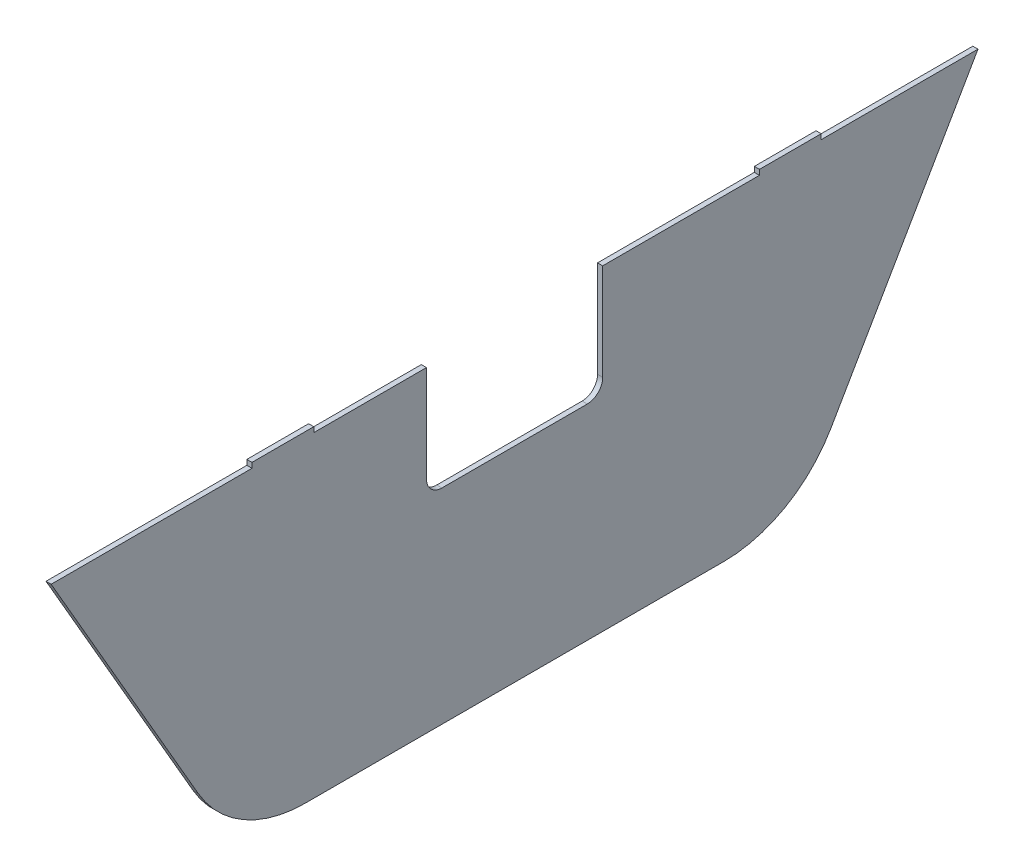
ISO-10303-21;
HEADER;
FILE_DESCRIPTION(('STEP AP214'),'2;1');
FILE_NAME('part.step','',(''),(''),'','','');
FILE_SCHEMA(('AUTOMOTIVE_DESIGN { 1 0 10303 214 1 1 1 1 }'));
ENDSEC;
DATA;
#1=APPLICATION_CONTEXT('core data for automotive mechanical design processes');
#2=APPLICATION_PROTOCOL_DEFINITION('international standard','automotive_design',2000,#1);
#3=PRODUCT_CONTEXT('',#1,'mechanical');
#4=PRODUCT('Part','Part','',(#3));
#5=PRODUCT_RELATED_PRODUCT_CATEGORY('part','',(#4));
#6=PRODUCT_DEFINITION_FORMATION('','',#4);
#7=PRODUCT_DEFINITION_CONTEXT('part definition',#1,'design');
#8=PRODUCT_DEFINITION('design','',#6,#7);
#9=PRODUCT_DEFINITION_SHAPE('','',#8);
#10=(LENGTH_UNIT() NAMED_UNIT(*) SI_UNIT(.MILLI.,.METRE.));
#11=(NAMED_UNIT(*) PLANE_ANGLE_UNIT() SI_UNIT($,.RADIAN.));
#12=(NAMED_UNIT(*) SI_UNIT($,.STERADIAN.) SOLID_ANGLE_UNIT());
#13=UNCERTAINTY_MEASURE_WITH_UNIT(LENGTH_MEASURE(1.E-05),#10,'distance_accuracy_value','');
#14=(GEOMETRIC_REPRESENTATION_CONTEXT(3) GLOBAL_UNCERTAINTY_ASSIGNED_CONTEXT((#13)) GLOBAL_UNIT_ASSIGNED_CONTEXT((#10,
#11,#12)) REPRESENTATION_CONTEXT('',''));
#15=CARTESIAN_POINT('',(0.,0.,0.));
#16=DIRECTION('',(0.,0.,1.));
#17=DIRECTION('',(1.,0.,0.));
#18=AXIS2_PLACEMENT_3D('',#15,#16,#17);
#19=CARTESIAN_POINT('',(2.,-2609.80652232953,-39.90228933812));
#20=DIRECTION('',(-1.,0.,0.));
#21=DIRECTION('',(0.,0.,1.));
#22=AXIS2_PLACEMENT_3D('',#19,#20,#21);
#23=CYLINDRICAL_SURFACE('',#22,47.9999999999999);
#24=CARTESIAN_POINT('',(0.,-2609.80652232953,-39.90228933812));
#25=DIRECTION('',(1.,0.,0.));
#26=DIRECTION('',(0.,0.,-1.));
#27=AXIS2_PLACEMENT_3D('',#24,#25,#26);
#28=CIRCLE('',#27,47.9999999999999);
#29=CARTESIAN_POINT('',(0.,-2633.80652232953,1.66693004353317));
#30=VERTEX_POINT('',#29);
#31=CARTESIAN_POINT('',(0.,-2657.80652232953,-39.90228933812));
#32=VERTEX_POINT('',#31);
#33=EDGE_CURVE('E205',#30,#32,#28,.T.);
#34=ORIENTED_EDGE('',*,*,#33,.T.);
#35=DIRECTION('',(-1.,0.,0.));
#36=VECTOR('',#35,1.);
#37=CARTESIAN_POINT('',(2.,-2657.80652232953,-39.90228933812));
#38=LINE('',#37,#36);
#39=CARTESIAN_POINT('',(2.,-2657.80652232953,-39.90228933812));
#40=VERTEX_POINT('',#39);
#41=EDGE_CURVE('E11',#40,#32,#38,.T.);
#42=ORIENTED_EDGE('',*,*,#41,.F.);
#43=CARTESIAN_POINT('',(2.,-2609.80652232953,-39.90228933812));
#44=DIRECTION('',(1.,0.,0.));
#45=DIRECTION('',(0.,0.,-1.));
#46=AXIS2_PLACEMENT_3D('',#43,#44,#45);
#47=CIRCLE('',#46,47.9999999999999);
#48=CARTESIAN_POINT('',(2.,-2633.80652232953,1.66693004353317));
#49=VERTEX_POINT('',#48);
#50=EDGE_CURVE('E256',#49,#40,#47,.T.);
#51=ORIENTED_EDGE('',*,*,#50,.F.);
#52=DIRECTION('',(-1.,0.,0.));
#53=VECTOR('',#52,1.);
#54=CARTESIAN_POINT('',(2.,-2633.80652232953,1.66693004353317));
#55=LINE('',#54,#53);
#56=EDGE_CURVE('E201',#49,#30,#55,.T.);
#57=ORIENTED_EDGE('',*,*,#56,.T.);
#58=EDGE_LOOP('',(#34,#42,#51,#57));
#59=FACE_BOUND('',#58,.T.);
#60=ADVANCED_FACE('F39',(#59),#23,.T.);
#61=CARTESIAN_POINT('',(2.,-2657.80652232953,-39.90228933812));
#62=DIRECTION('',(0.,1.,0.));
#63=DIRECTION('',(0.,0.,1.));
#64=AXIS2_PLACEMENT_3D('',#61,#62,#63);
#65=PLANE('',#64);
#66=DIRECTION('',(0.,0.,-1.));
#67=VECTOR('',#66,1.);
#68=CARTESIAN_POINT('',(0.,-2657.80652232953,-39.90228933812));
#69=LINE('',#68,#67);
#70=CARTESIAN_POINT('',(0.,-2657.80652232953,-202.448497275268));
#71=VERTEX_POINT('',#70);
#72=EDGE_CURVE('E208',#32,#71,#69,.T.);
#73=ORIENTED_EDGE('',*,*,#72,.T.);
#74=DIRECTION('',(-1.,0.,0.));
#75=VECTOR('',#74,1.);
#76=CARTESIAN_POINT('',(2.,-2657.80652232953,-202.448497275268));
#77=LINE('',#76,#75);
#78=CARTESIAN_POINT('',(2.,-2657.80652232953,-202.448497275268));
#79=VERTEX_POINT('',#78);
#80=EDGE_CURVE('E47',#79,#71,#77,.T.);
#81=ORIENTED_EDGE('',*,*,#80,.F.);
#82=DIRECTION('',(0.,0.,-1.));
#83=VECTOR('',#82,1.);
#84=CARTESIAN_POINT('',(2.,-2657.80652232953,-39.90228933812));
#85=LINE('',#84,#83);
#86=EDGE_CURVE('E130',#40,#79,#85,.T.);
#87=ORIENTED_EDGE('',*,*,#86,.F.);
#88=ORIENTED_EDGE('',*,*,#41,.T.);
#89=EDGE_LOOP('',(#73,#81,#87,#88));
#90=FACE_BOUND('',#89,.T.);
#91=ADVANCED_FACE('F361',(#90),#65,.F.);
#92=CARTESIAN_POINT('',(2.,-2609.80652232953,-202.448497275268));
#93=DIRECTION('',(-1.,0.,0.));
#94=DIRECTION('',(0.,0.,1.));
#95=AXIS2_PLACEMENT_3D('',#92,#93,#94);
#96=CYLINDRICAL_SURFACE('',#95,48.0000000000001);
#97=CARTESIAN_POINT('',(0.,-2609.80652232953,-202.448497275268));
#98=DIRECTION('',(1.,0.,0.));
#99=DIRECTION('',(0.,0.,-1.));
#100=AXIS2_PLACEMENT_3D('',#97,#98,#99);
#101=CIRCLE('',#100,48.0000000000001);
#102=CARTESIAN_POINT('',(0.,-2633.80652232953,-244.017716656921));
#103=VERTEX_POINT('',#102);
#104=EDGE_CURVE('E210',#71,#103,#101,.T.);
#105=ORIENTED_EDGE('',*,*,#104,.T.);
#106=DIRECTION('',(-1.,0.,0.));
#107=VECTOR('',#106,1.);
#108=CARTESIAN_POINT('',(2.,-2633.80652232953,-244.017716656921));
#109=LINE('',#108,#107);
#110=CARTESIAN_POINT('',(2.,-2633.80652232953,-244.017716656921));
#111=VERTEX_POINT('',#110);
#112=EDGE_CURVE('E288',#111,#103,#109,.T.);
#113=ORIENTED_EDGE('',*,*,#112,.F.);
#114=CARTESIAN_POINT('',(2.,-2609.80652232953,-202.448497275268));
#115=DIRECTION('',(1.,0.,0.));
#116=DIRECTION('',(0.,0.,-1.));
#117=AXIS2_PLACEMENT_3D('',#114,#115,#116);
#118=CIRCLE('',#117,48.0000000000001);
#119=EDGE_CURVE('E296',#79,#111,#118,.T.);
#120=ORIENTED_EDGE('',*,*,#119,.F.);
#121=ORIENTED_EDGE('',*,*,#80,.T.);
#122=EDGE_LOOP('',(#105,#113,#120,#121));
#123=FACE_BOUND('',#122,.T.);
#124=ADVANCED_FACE('F294',(#123),#96,.T.);
#125=CARTESIAN_POINT('',(2.,-2633.80652232953,-244.017716656921));
#126=DIRECTION('',(0.,0.499999999999997,0.86602540378444));
#127=DIRECTION('',(0.,-0.86602540378444,0.499999999999997));
#128=AXIS2_PLACEMENT_3D('',#125,#126,#127);
#129=PLANE('',#128);
#130=DIRECTION('',(0.,0.86602540378444,-0.499999999999997));
#131=VECTOR('',#130,1.);
#132=CARTESIAN_POINT('',(0.,-2633.80652232953,-244.017716656921));
#133=LINE('',#132,#131);
#134=CARTESIAN_POINT('',(0.,-2534.80652232953,-301.175393306694));
#135=VERTEX_POINT('',#134);
#136=EDGE_CURVE('E212',#103,#135,#133,.T.);
#137=ORIENTED_EDGE('',*,*,#136,.T.);
#138=DIRECTION('',(-1.,0.,0.));
#139=VECTOR('',#138,1.);
#140=CARTESIAN_POINT('',(2.,-2534.80652232953,-301.175393306694));
#141=LINE('',#140,#139);
#142=CARTESIAN_POINT('',(2.,-2534.80652232953,-301.175393306694));
#143=VERTEX_POINT('',#142);
#144=EDGE_CURVE('E286',#143,#135,#141,.T.);
#145=ORIENTED_EDGE('',*,*,#144,.F.);
#146=DIRECTION('',(0.,0.86602540378444,-0.499999999999997));
#147=VECTOR('',#146,1.);
#148=CARTESIAN_POINT('',(2.,-2633.80652232953,-244.017716656921));
#149=LINE('',#148,#147);
#150=EDGE_CURVE('E308',#111,#143,#149,.T.);
#151=ORIENTED_EDGE('',*,*,#150,.F.);
#152=ORIENTED_EDGE('',*,*,#112,.T.);
#153=EDGE_LOOP('',(#137,#145,#151,#152));
#154=FACE_BOUND('',#153,.T.);
#155=ADVANCED_FACE('F305',(#154),#129,.F.);
#156=CARTESIAN_POINT('',(2.,-2534.80652232953,-240.287893306695));
#157=DIRECTION('',(0.,1.,0.));
#158=DIRECTION('',(0.,0.,1.));
#159=AXIS2_PLACEMENT_3D('',#156,#157,#158);
#160=PLANE('',#159);
#161=DIRECTION('',(0.,0.,-1.));
#162=VECTOR('',#161,1.);
#163=CARTESIAN_POINT('',(0.,-2534.80652232953,-240.287893306695));
#164=LINE('',#163,#162);
#165=CARTESIAN_POINT('',(0.,-2534.80652232953,-240.287893306695));
#166=VERTEX_POINT('',#165);
#167=EDGE_CURVE('E215',#166,#135,#164,.T.);
#168=ORIENTED_EDGE('',*,*,#167,.F.);
#169=DIRECTION('',(-1.,0.,0.));
#170=VECTOR('',#169,1.);
#171=CARTESIAN_POINT('',(2.,-2534.80652232953,-240.287893306695));
#172=LINE('',#171,#170);
#173=CARTESIAN_POINT('',(2.,-2534.80652232953,-240.287893306695));
#174=VERTEX_POINT('',#173);
#175=EDGE_CURVE('E284',#174,#166,#172,.T.);
#176=ORIENTED_EDGE('',*,*,#175,.F.);
#177=DIRECTION('',(0.,0.,-1.));
#178=VECTOR('',#177,1.);
#179=CARTESIAN_POINT('',(2.,-2534.80652232953,-240.287893306695));
#180=LINE('',#179,#178);
#181=EDGE_CURVE('E310',#174,#143,#180,.T.);
#182=ORIENTED_EDGE('',*,*,#181,.T.);
#183=ORIENTED_EDGE('',*,*,#144,.T.);
#184=EDGE_LOOP('',(#168,#176,#182,#183));
#185=FACE_BOUND('',#184,.T.);
#186=ADVANCED_FACE('F372',(#185),#160,.T.);
#187=CARTESIAN_POINT('',(2.,-2534.80652232953,-240.287893306695));
#188=DIRECTION('',(0.,0.,1.));
#189=DIRECTION('',(1.,0.,0.));
#190=AXIS2_PLACEMENT_3D('',#187,#188,#189);
#191=PLANE('',#190);
#192=DIRECTION('',(0.,1.,0.));
#193=VECTOR('',#192,1.);
#194=CARTESIAN_POINT('',(0.,-2534.80652232953,-240.287893306695));
#195=LINE('',#194,#193);
#196=CARTESIAN_POINT('',(0.,-2532.80652232953,-240.287893306695));
#197=VERTEX_POINT('',#196);
#198=EDGE_CURVE('E218',#166,#197,#195,.T.);
#199=ORIENTED_EDGE('',*,*,#198,.T.);
#200=DIRECTION('',(-1.,0.,0.));
#201=VECTOR('',#200,1.);
#202=CARTESIAN_POINT('',(2.,-2532.80652232953,-240.287893306695));
#203=LINE('',#202,#201);
#204=CARTESIAN_POINT('',(2.,-2532.80652232953,-240.287893306695));
#205=VERTEX_POINT('',#204);
#206=EDGE_CURVE('E282',#205,#197,#203,.T.);
#207=ORIENTED_EDGE('',*,*,#206,.F.);
#208=DIRECTION('',(0.,1.,0.));
#209=VECTOR('',#208,1.);
#210=CARTESIAN_POINT('',(2.,-2534.80652232953,-240.287893306695));
#211=LINE('',#210,#209);
#212=EDGE_CURVE('E312',#174,#205,#211,.T.);
#213=ORIENTED_EDGE('',*,*,#212,.F.);
#214=ORIENTED_EDGE('',*,*,#175,.T.);
#215=EDGE_LOOP('',(#199,#207,#213,#214));
#216=FACE_BOUND('',#215,.T.);
#217=ADVANCED_FACE('F375',(#216),#191,.F.);
#218=CARTESIAN_POINT('',(2.,-2532.80652232953,-216.287893306695));
#219=DIRECTION('',(0.,1.,0.));
#220=DIRECTION('',(0.,0.,1.));
#221=AXIS2_PLACEMENT_3D('',#218,#219,#220);
#222=PLANE('',#221);
#223=DIRECTION('',(0.,0.,-1.));
#224=VECTOR('',#223,1.);
#225=CARTESIAN_POINT('',(0.,-2532.80652232953,-216.287893306695));
#226=LINE('',#225,#224);
#227=CARTESIAN_POINT('',(0.,-2532.80652232953,-216.287893306695));
#228=VERTEX_POINT('',#227);
#229=EDGE_CURVE('E221',#228,#197,#226,.T.);
#230=ORIENTED_EDGE('',*,*,#229,.F.);
#231=DIRECTION('',(-1.,0.,0.));
#232=VECTOR('',#231,1.);
#233=CARTESIAN_POINT('',(2.,-2532.80652232953,-216.287893306695));
#234=LINE('',#233,#232);
#235=CARTESIAN_POINT('',(2.,-2532.80652232953,-216.287893306695));
#236=VERTEX_POINT('',#235);
#237=EDGE_CURVE('E280',#236,#228,#234,.T.);
#238=ORIENTED_EDGE('',*,*,#237,.F.);
#239=DIRECTION('',(0.,0.,-1.));
#240=VECTOR('',#239,1.);
#241=CARTESIAN_POINT('',(2.,-2532.80652232953,-216.287893306695));
#242=LINE('',#241,#240);
#243=EDGE_CURVE('E318',#236,#205,#242,.T.);
#244=ORIENTED_EDGE('',*,*,#243,.T.);
#245=ORIENTED_EDGE('',*,*,#206,.T.);
#246=EDGE_LOOP('',(#230,#238,#244,#245));
#247=FACE_BOUND('',#246,.T.);
#248=ADVANCED_FACE('F379',(#247),#222,.T.);
#249=CARTESIAN_POINT('',(2.,-2534.80652232953,-216.287893306695));
#250=DIRECTION('',(0.,0.,1.));
#251=DIRECTION('',(1.,0.,0.));
#252=AXIS2_PLACEMENT_3D('',#249,#250,#251);
#253=PLANE('',#252);
#254=DIRECTION('',(0.,1.,0.));
#255=VECTOR('',#254,1.);
#256=CARTESIAN_POINT('',(0.,-2534.80652232953,-216.287893306695));
#257=LINE('',#256,#255);
#258=CARTESIAN_POINT('',(0.,-2534.80652232953,-216.287893306695));
#259=VERTEX_POINT('',#258);
#260=EDGE_CURVE('E224',#259,#228,#257,.T.);
#261=ORIENTED_EDGE('',*,*,#260,.F.);
#262=DIRECTION('',(-1.,0.,0.));
#263=VECTOR('',#262,1.);
#264=CARTESIAN_POINT('',(2.,-2534.80652232953,-216.287893306695));
#265=LINE('',#264,#263);
#266=CARTESIAN_POINT('',(2.,-2534.80652232953,-216.287893306695));
#267=VERTEX_POINT('',#266);
#268=EDGE_CURVE('E278',#267,#259,#265,.T.);
#269=ORIENTED_EDGE('',*,*,#268,.F.);
#270=DIRECTION('',(0.,1.,0.));
#271=VECTOR('',#270,1.);
#272=CARTESIAN_POINT('',(2.,-2534.80652232953,-216.287893306695));
#273=LINE('',#272,#271);
#274=EDGE_CURVE('E321',#267,#236,#273,.T.);
#275=ORIENTED_EDGE('',*,*,#274,.T.);
#276=ORIENTED_EDGE('',*,*,#237,.T.);
#277=EDGE_LOOP('',(#261,#269,#275,#276));
#278=FACE_BOUND('',#277,.T.);
#279=ADVANCED_FACE('F383',(#278),#253,.T.);
#280=CARTESIAN_POINT('',(2.,-2534.80652232953,-155.400393306695));
#281=DIRECTION('',(0.,1.,0.));
#282=DIRECTION('',(0.,0.,1.));
#283=AXIS2_PLACEMENT_3D('',#280,#281,#282);
#284=PLANE('',#283);
#285=DIRECTION('',(0.,0.,-1.));
#286=VECTOR('',#285,1.);
#287=CARTESIAN_POINT('',(0.,-2534.80652232953,-155.400393306695));
#288=LINE('',#287,#286);
#289=CARTESIAN_POINT('',(0.,-2534.80652232953,-155.400393306695));
#290=VERTEX_POINT('',#289);
#291=EDGE_CURVE('E227',#290,#259,#288,.T.);
#292=ORIENTED_EDGE('',*,*,#291,.F.);
#293=DIRECTION('',(-1.,0.,0.));
#294=VECTOR('',#293,1.);
#295=CARTESIAN_POINT('',(2.,-2534.80652232953,-155.400393306695));
#296=LINE('',#295,#294);
#297=CARTESIAN_POINT('',(2.,-2534.80652232953,-155.400393306695));
#298=VERTEX_POINT('',#297);
#299=EDGE_CURVE('E276',#298,#290,#296,.T.);
#300=ORIENTED_EDGE('',*,*,#299,.F.);
#301=DIRECTION('',(0.,0.,-1.));
#302=VECTOR('',#301,1.);
#303=CARTESIAN_POINT('',(2.,-2534.80652232953,-155.400393306695));
#304=LINE('',#303,#302);
#305=EDGE_CURVE('E324',#298,#267,#304,.T.);
#306=ORIENTED_EDGE('',*,*,#305,.T.);
#307=ORIENTED_EDGE('',*,*,#268,.T.);
#308=EDGE_LOOP('',(#292,#300,#306,#307));
#309=FACE_BOUND('',#308,.T.);
#310=ADVANCED_FACE('F387',(#309),#284,.T.);
#311=CARTESIAN_POINT('',(2.,-2534.80652232953,-155.400393306695));
#312=DIRECTION('',(0.,0.,-1.));
#313=DIRECTION('',(-1.,0.,0.));
#314=AXIS2_PLACEMENT_3D('',#311,#312,#313);
#315=PLANE('',#314);
#316=DIRECTION('',(0.,-1.,0.));
#317=VECTOR('',#316,1.);
#318=CARTESIAN_POINT('',(0.,-2534.80652232953,-155.400393306695));
#319=LINE('',#318,#317);
#320=CARTESIAN_POINT('',(0.,-2572.30652232953,-155.400393306695));
#321=VERTEX_POINT('',#320);
#322=EDGE_CURVE('E230',#290,#321,#319,.T.);
#323=ORIENTED_EDGE('',*,*,#322,.T.);
#324=DIRECTION('',(-1.,0.,0.));
#325=VECTOR('',#324,1.);
#326=CARTESIAN_POINT('',(2.,-2572.30652232953,-155.400393306695));
#327=LINE('',#326,#325);
#328=CARTESIAN_POINT('',(2.,-2572.30652232953,-155.400393306695));
#329=VERTEX_POINT('',#328);
#330=EDGE_CURVE('E273',#329,#321,#327,.T.);
#331=ORIENTED_EDGE('',*,*,#330,.F.);
#332=DIRECTION('',(0.,-1.,0.));
#333=VECTOR('',#332,1.);
#334=CARTESIAN_POINT('',(2.,-2534.80652232953,-155.400393306695));
#335=LINE('',#334,#333);
#336=EDGE_CURVE('E327',#298,#329,#335,.T.);
#337=ORIENTED_EDGE('',*,*,#336,.F.);
#338=ORIENTED_EDGE('',*,*,#299,.T.);
#339=EDGE_LOOP('',(#323,#331,#337,#338));
#340=FACE_BOUND('',#339,.T.);
#341=ADVANCED_FACE('F391',(#340),#315,.F.);
#342=CARTESIAN_POINT('',(2.,-2572.30652232953,-149.400393306695));
#343=DIRECTION('',(-1.,0.,0.));
#344=DIRECTION('',(0.,0.,1.));
#345=AXIS2_PLACEMENT_3D('',#342,#343,#344);
#346=CYLINDRICAL_SURFACE('',#345,5.99999999999989);
#347=CARTESIAN_POINT('',(0.,-2572.30652232953,-149.400393306695));
#348=DIRECTION('',(-1.,0.,0.));
#349=DIRECTION('',(0.,0.,1.));
#350=AXIS2_PLACEMENT_3D('',#347,#348,#349);
#351=CIRCLE('',#350,5.99999999999989);
#352=CARTESIAN_POINT('',(0.,-2578.30652232953,-149.400393306695));
#353=VERTEX_POINT('',#352);
#354=EDGE_CURVE('E232',#321,#353,#351,.T.);
#355=ORIENTED_EDGE('',*,*,#354,.T.);
#356=DIRECTION('',(-1.,0.,0.));
#357=VECTOR('',#356,1.);
#358=CARTESIAN_POINT('',(2.,-2578.30652232953,-149.400393306695));
#359=LINE('',#358,#357);
#360=CARTESIAN_POINT('',(2.,-2578.30652232953,-149.400393306695));
#361=VERTEX_POINT('',#360);
#362=EDGE_CURVE('E270',#361,#353,#359,.T.);
#363=ORIENTED_EDGE('',*,*,#362,.F.);
#364=CARTESIAN_POINT('',(2.,-2572.30652232953,-149.400393306695));
#365=DIRECTION('',(-1.,0.,0.));
#366=DIRECTION('',(0.,0.,1.));
#367=AXIS2_PLACEMENT_3D('',#364,#365,#366);
#368=CIRCLE('',#367,5.99999999999989);
#369=EDGE_CURVE('E329',#329,#361,#368,.T.);
#370=ORIENTED_EDGE('',*,*,#369,.F.);
#371=ORIENTED_EDGE('',*,*,#330,.T.);
#372=EDGE_LOOP('',(#355,#363,#370,#371));
#373=FACE_BOUND('',#372,.T.);
#374=ADVANCED_FACE('F395',(#373),#346,.F.);
#375=CARTESIAN_POINT('',(2.,-2578.30652232953,-149.400393306695));
#376=DIRECTION('',(0.,-1.,0.));
#377=DIRECTION('',(0.,0.,-1.));
#378=AXIS2_PLACEMENT_3D('',#375,#376,#377);
#379=PLANE('',#378);
#380=DIRECTION('',(0.,0.,1.));
#381=VECTOR('',#380,1.);
#382=CARTESIAN_POINT('',(0.,-2578.30652232953,-149.400393306695));
#383=LINE('',#382,#381);
#384=CARTESIAN_POINT('',(0.,-2578.30652232953,-92.9503933066952));
#385=VERTEX_POINT('',#384);
#386=EDGE_CURVE('E234',#353,#385,#383,.T.);
#387=ORIENTED_EDGE('',*,*,#386,.T.);
#388=DIRECTION('',(-1.,0.,0.));
#389=VECTOR('',#388,1.);
#390=CARTESIAN_POINT('',(2.,-2578.30652232953,-92.9503933066952));
#391=LINE('',#390,#389);
#392=CARTESIAN_POINT('',(2.,-2578.30652232953,-92.9503933066952));
#393=VERTEX_POINT('',#392);
#394=EDGE_CURVE('E268',#393,#385,#391,.T.);
#395=ORIENTED_EDGE('',*,*,#394,.F.);
#396=DIRECTION('',(0.,0.,1.));
#397=VECTOR('',#396,1.);
#398=CARTESIAN_POINT('',(2.,-2578.30652232953,-149.400393306695));
#399=LINE('',#398,#397);
#400=EDGE_CURVE('E331',#361,#393,#399,.T.);
#401=ORIENTED_EDGE('',*,*,#400,.F.);
#402=ORIENTED_EDGE('',*,*,#362,.T.);
#403=EDGE_LOOP('',(#387,#395,#401,#402));
#404=FACE_BOUND('',#403,.T.);
#405=ADVANCED_FACE('F399',(#404),#379,.F.);
#406=CARTESIAN_POINT('',(2.,-2572.30652232953,-92.9503933066952));
#407=DIRECTION('',(-1.,0.,0.));
#408=DIRECTION('',(0.,0.,1.));
#409=AXIS2_PLACEMENT_3D('',#406,#407,#408);
#410=CYLINDRICAL_SURFACE('',#409,5.99999999999989);
#411=CARTESIAN_POINT('',(0.,-2572.30652232953,-92.9503933066952));
#412=DIRECTION('',(1.,0.,0.));
#413=DIRECTION('',(0.,0.,-1.));
#414=AXIS2_PLACEMENT_3D('',#411,#412,#413);
#415=CIRCLE('',#414,5.99999999999989);
#416=CARTESIAN_POINT('',(0.,-2572.30652232953,-86.9503933066953));
#417=VERTEX_POINT('',#416);
#418=EDGE_CURVE('E237',#417,#385,#415,.T.);
#419=ORIENTED_EDGE('',*,*,#418,.F.);
#420=DIRECTION('',(-1.,0.,0.));
#421=VECTOR('',#420,1.);
#422=CARTESIAN_POINT('',(2.,-2572.30652232953,-86.9503933066953));
#423=LINE('',#422,#421);
#424=CARTESIAN_POINT('',(2.,-2572.30652232953,-86.9503933066953));
#425=VERTEX_POINT('',#424);
#426=EDGE_CURVE('E266',#425,#417,#423,.T.);
#427=ORIENTED_EDGE('',*,*,#426,.F.);
#428=CARTESIAN_POINT('',(2.,-2572.30652232953,-92.9503933066952));
#429=DIRECTION('',(1.,0.,0.));
#430=DIRECTION('',(0.,0.,-1.));
#431=AXIS2_PLACEMENT_3D('',#428,#429,#430);
#432=CIRCLE('',#431,5.99999999999989);
#433=EDGE_CURVE('E333',#425,#393,#432,.T.);
#434=ORIENTED_EDGE('',*,*,#433,.T.);
#435=ORIENTED_EDGE('',*,*,#394,.T.);
#436=EDGE_LOOP('',(#419,#427,#434,#435));
#437=FACE_BOUND('',#436,.T.);
#438=ADVANCED_FACE('F403',(#437),#410,.F.);
#439=CARTESIAN_POINT('',(2.,-2572.30652232953,-86.9503933066952));
#440=DIRECTION('',(0.,0.,1.));
#441=DIRECTION('',(1.,0.,0.));
#442=AXIS2_PLACEMENT_3D('',#439,#440,#441);
#443=PLANE('',#442);
#444=DIRECTION('',(0.,1.,0.));
#445=VECTOR('',#444,1.);
#446=CARTESIAN_POINT('',(0.,-2572.30652232953,-86.9503933066952));
#447=LINE('',#446,#445);
#448=CARTESIAN_POINT('',(0.,-2534.80652232953,-86.9503933066952));
#449=VERTEX_POINT('',#448);
#450=EDGE_CURVE('E240',#417,#449,#447,.T.);
#451=ORIENTED_EDGE('',*,*,#450,.T.);
#452=DIRECTION('',(-1.,0.,0.));
#453=VECTOR('',#452,1.);
#454=CARTESIAN_POINT('',(2.,-2534.80652232953,-86.9503933066952));
#455=LINE('',#454,#453);
#456=CARTESIAN_POINT('',(2.,-2534.80652232953,-86.9503933066952));
#457=VERTEX_POINT('',#456);
#458=EDGE_CURVE('E264',#457,#449,#455,.T.);
#459=ORIENTED_EDGE('',*,*,#458,.F.);
#460=DIRECTION('',(0.,1.,0.));
#461=VECTOR('',#460,1.);
#462=CARTESIAN_POINT('',(2.,-2572.30652232953,-86.9503933066952));
#463=LINE('',#462,#461);
#464=EDGE_CURVE('E336',#425,#457,#463,.T.);
#465=ORIENTED_EDGE('',*,*,#464,.F.);
#466=ORIENTED_EDGE('',*,*,#426,.T.);
#467=EDGE_LOOP('',(#451,#459,#465,#466));
#468=FACE_BOUND('',#467,.T.);
#469=ADVANCED_FACE('F407',(#468),#443,.F.);
#470=CARTESIAN_POINT('',(2.,-2534.80652232953,-43.1753933066941));
#471=DIRECTION('',(0.,1.,0.));
#472=DIRECTION('',(0.,0.,1.));
#473=AXIS2_PLACEMENT_3D('',#470,#471,#472);
#474=PLANE('',#473);
#475=DIRECTION('',(0.,0.,-1.));
#476=VECTOR('',#475,1.);
#477=CARTESIAN_POINT('',(0.,-2534.80652232953,-43.1753933066941));
#478=LINE('',#477,#476);
#479=CARTESIAN_POINT('',(0.,-2534.80652232953,-43.1753933066941));
#480=VERTEX_POINT('',#479);
#481=EDGE_CURVE('E243',#480,#449,#478,.T.);
#482=ORIENTED_EDGE('',*,*,#481,.F.);
#483=DIRECTION('',(-1.,0.,0.));
#484=VECTOR('',#483,1.);
#485=CARTESIAN_POINT('',(2.,-2534.80652232953,-43.1753933066941));
#486=LINE('',#485,#484);
#487=CARTESIAN_POINT('',(2.,-2534.80652232953,-43.1753933066941));
#488=VERTEX_POINT('',#487);
#489=EDGE_CURVE('E262',#488,#480,#486,.T.);
#490=ORIENTED_EDGE('',*,*,#489,.F.);
#491=DIRECTION('',(0.,0.,-1.));
#492=VECTOR('',#491,1.);
#493=CARTESIAN_POINT('',(2.,-2534.80652232953,-43.1753933066941));
#494=LINE('',#493,#492);
#495=EDGE_CURVE('E338',#488,#457,#494,.T.);
#496=ORIENTED_EDGE('',*,*,#495,.T.);
#497=ORIENTED_EDGE('',*,*,#458,.T.);
#498=EDGE_LOOP('',(#482,#490,#496,#497));
#499=FACE_BOUND('',#498,.T.);
#500=ADVANCED_FACE('F411',(#499),#474,.T.);
#501=CARTESIAN_POINT('',(2.,-2534.80652232953,-43.1753933066941));
#502=DIRECTION('',(0.,0.,1.));
#503=DIRECTION('',(0.,-1.,0.));
#504=AXIS2_PLACEMENT_3D('',#501,#502,#503);
#505=PLANE('',#504);
#506=DIRECTION('',(0.,1.,0.));
#507=VECTOR('',#506,1.);
#508=CARTESIAN_POINT('',(0.,-2534.80652232953,-43.1753933066941));
#509=LINE('',#508,#507);
#510=CARTESIAN_POINT('',(0.,-2532.80652232953,-43.1753933066941));
#511=VERTEX_POINT('',#510);
#512=EDGE_CURVE('E246',#480,#511,#509,.T.);
#513=ORIENTED_EDGE('',*,*,#512,.T.);
#514=DIRECTION('',(-1.,0.,0.));
#515=VECTOR('',#514,1.);
#516=CARTESIAN_POINT('',(2.,-2532.80652232953,-43.1753933066941));
#517=LINE('',#516,#515);
#518=CARTESIAN_POINT('',(2.,-2532.80652232953,-43.1753933066941));
#519=VERTEX_POINT('',#518);
#520=EDGE_CURVE('E260',#519,#511,#517,.T.);
#521=ORIENTED_EDGE('',*,*,#520,.F.);
#522=DIRECTION('',(0.,1.,0.));
#523=VECTOR('',#522,1.);
#524=CARTESIAN_POINT('',(2.,-2534.80652232953,-43.1753933066941));
#525=LINE('',#524,#523);
#526=EDGE_CURVE('E341',#488,#519,#525,.T.);
#527=ORIENTED_EDGE('',*,*,#526,.F.);
#528=ORIENTED_EDGE('',*,*,#489,.T.);
#529=EDGE_LOOP('',(#513,#521,#527,#528));
#530=FACE_BOUND('',#529,.T.);
#531=ADVANCED_FACE('F415',(#530),#505,.F.);
#532=CARTESIAN_POINT('',(2.,-2532.80652232953,-19.1753933066941));
#533=DIRECTION('',(0.,1.,0.));
#534=DIRECTION('',(0.,0.,1.));
#535=AXIS2_PLACEMENT_3D('',#532,#533,#534);
#536=PLANE('',#535);
#537=DIRECTION('',(0.,0.,-1.));
#538=VECTOR('',#537,1.);
#539=CARTESIAN_POINT('',(0.,-2532.80652232953,-19.1753933066941));
#540=LINE('',#539,#538);
#541=CARTESIAN_POINT('',(0.,-2532.80652232953,-19.1753933066941));
#542=VERTEX_POINT('',#541);
#543=EDGE_CURVE('E249',#542,#511,#540,.T.);
#544=ORIENTED_EDGE('',*,*,#543,.F.);
#545=DIRECTION('',(-1.,0.,0.));
#546=VECTOR('',#545,1.);
#547=CARTESIAN_POINT('',(2.,-2532.80652232953,-19.1753933066941));
#548=LINE('',#547,#546);
#549=CARTESIAN_POINT('',(2.,-2532.80652232953,-19.1753933066941));
#550=VERTEX_POINT('',#549);
#551=EDGE_CURVE('E191',#550,#542,#548,.T.);
#552=ORIENTED_EDGE('',*,*,#551,.F.);
#553=DIRECTION('',(0.,0.,-1.));
#554=VECTOR('',#553,1.);
#555=CARTESIAN_POINT('',(2.,-2532.80652232953,-19.1753933066941));
#556=LINE('',#555,#554);
#557=EDGE_CURVE('E197',#550,#519,#556,.T.);
#558=ORIENTED_EDGE('',*,*,#557,.T.);
#559=ORIENTED_EDGE('',*,*,#520,.T.);
#560=EDGE_LOOP('',(#544,#552,#558,#559));
#561=FACE_BOUND('',#560,.T.);
#562=ADVANCED_FACE('F344',(#561),#536,.T.);
#563=CARTESIAN_POINT('',(2.,-2534.80652232953,-19.1753933066941));
#564=DIRECTION('',(0.,0.,1.));
#565=DIRECTION('',(1.,0.,0.));
#566=AXIS2_PLACEMENT_3D('',#563,#564,#565);
#567=PLANE('',#566);
#568=DIRECTION('',(0.,1.,0.));
#569=VECTOR('',#568,1.);
#570=CARTESIAN_POINT('',(0.,-2534.80652232953,-19.1753933066941));
#571=LINE('',#570,#569);
#572=CARTESIAN_POINT('',(0.,-2534.80652232953,-19.1753933066941));
#573=VERTEX_POINT('',#572);
#574=EDGE_CURVE('E186',#573,#542,#571,.T.);
#575=ORIENTED_EDGE('',*,*,#574,.F.);
#576=DIRECTION('',(-1.,0.,0.));
#577=VECTOR('',#576,1.);
#578=CARTESIAN_POINT('',(2.,-2534.80652232953,-19.1753933066941));
#579=LINE('',#578,#577);
#580=CARTESIAN_POINT('',(2.,-2534.80652232953,-19.1753933066941));
#581=VERTEX_POINT('',#580);
#582=EDGE_CURVE('E181',#581,#573,#579,.T.);
#583=ORIENTED_EDGE('',*,*,#582,.F.);
#584=DIRECTION('',(0.,1.,0.));
#585=VECTOR('',#584,1.);
#586=CARTESIAN_POINT('',(2.,-2534.80652232953,-19.1753933066941));
#587=LINE('',#586,#585);
#588=EDGE_CURVE('E184',#581,#550,#587,.T.);
#589=ORIENTED_EDGE('',*,*,#588,.T.);
#590=ORIENTED_EDGE('',*,*,#551,.T.);
#591=EDGE_LOOP('',(#575,#583,#589,#590));
#592=FACE_BOUND('',#591,.T.);
#593=ADVANCED_FACE('F183',(#592),#567,.T.);
#594=CARTESIAN_POINT('',(2.,-2534.80652232953,58.8246066933059));
#595=DIRECTION('',(0.,1.,0.));
#596=DIRECTION('',(0.,0.,1.));
#597=AXIS2_PLACEMENT_3D('',#594,#595,#596);
#598=PLANE('',#597);
#599=DIRECTION('',(0.,0.,-1.));
#600=VECTOR('',#599,1.);
#601=CARTESIAN_POINT('',(0.,-2534.80652232953,58.8246066933059));
#602=LINE('',#601,#600);
#603=CARTESIAN_POINT('',(0.,-2534.80652232953,58.8246066933059));
#604=VERTEX_POINT('',#603);
#605=EDGE_CURVE('E253',#604,#573,#602,.T.);
#606=ORIENTED_EDGE('',*,*,#605,.F.);
#607=DIRECTION('',(-1.,0.,0.));
#608=VECTOR('',#607,1.);
#609=CARTESIAN_POINT('',(2.,-2534.80652232953,58.8246066933059));
#610=LINE('',#609,#608);
#611=CARTESIAN_POINT('',(2.,-2534.80652232953,58.8246066933059));
#612=VERTEX_POINT('',#611);
#613=EDGE_CURVE('E119',#612,#604,#610,.T.);
#614=ORIENTED_EDGE('',*,*,#613,.F.);
#615=DIRECTION('',(0.,0.,-1.));
#616=VECTOR('',#615,1.);
#617=CARTESIAN_POINT('',(2.,-2534.80652232953,58.8246066933059));
#618=LINE('',#617,#616);
#619=EDGE_CURVE('E195',#612,#581,#618,.T.);
#620=ORIENTED_EDGE('',*,*,#619,.T.);
#621=ORIENTED_EDGE('',*,*,#582,.T.);
#622=EDGE_LOOP('',(#606,#614,#620,#621));
#623=FACE_BOUND('',#622,.T.);
#624=ADVANCED_FACE('F199',(#623),#598,.T.);
#625=CARTESIAN_POINT('',(2.,-2534.80652232953,58.8246066933059));
#626=DIRECTION('',(0.,0.499999999999998,-0.86602540378444));
#627=DIRECTION('',(0.,0.86602540378444,0.499999999999998));
#628=AXIS2_PLACEMENT_3D('',#625,#626,#627);
#629=PLANE('',#628);
#630=DIRECTION('',(0.,-0.86602540378444,-0.499999999999998));
#631=VECTOR('',#630,1.);
#632=CARTESIAN_POINT('',(0.,-2534.80652232953,58.8246066933059));
#633=LINE('',#632,#631);
#634=EDGE_CURVE('E122',#604,#30,#633,.T.);
#635=ORIENTED_EDGE('',*,*,#634,.T.);
#636=ORIENTED_EDGE('',*,*,#56,.F.);
#637=DIRECTION('',(0.,-0.86602540378444,-0.499999999999998));
#638=VECTOR('',#637,1.);
#639=CARTESIAN_POINT('',(2.,-2534.80652232953,58.8246066933059));
#640=LINE('',#639,#638);
#641=EDGE_CURVE('E55',#612,#49,#640,.T.);
#642=ORIENTED_EDGE('',*,*,#641,.F.);
#643=ORIENTED_EDGE('',*,*,#613,.T.);
#644=EDGE_LOOP('',(#635,#636,#642,#643));
#645=FACE_BOUND('',#644,.T.);
#646=ADVANCED_FACE('F350',(#645),#629,.F.);
#647=CARTESIAN_POINT('',(2.,-2609.80652232953,-39.90228933812));
#648=DIRECTION('',(1.,0.,0.));
#649=DIRECTION('',(0.,0.,-1.));
#650=AXIS2_PLACEMENT_3D('',#647,#648,#649);
#651=PLANE('',#650);
#652=ORIENTED_EDGE('',*,*,#50,.T.);
#653=ORIENTED_EDGE('',*,*,#86,.T.);
#654=ORIENTED_EDGE('',*,*,#119,.T.);
#655=ORIENTED_EDGE('',*,*,#150,.T.);
#656=ORIENTED_EDGE('',*,*,#181,.F.);
#657=ORIENTED_EDGE('',*,*,#212,.T.);
#658=ORIENTED_EDGE('',*,*,#243,.F.);
#659=ORIENTED_EDGE('',*,*,#274,.F.);
#660=ORIENTED_EDGE('',*,*,#305,.F.);
#661=ORIENTED_EDGE('',*,*,#336,.T.);
#662=ORIENTED_EDGE('',*,*,#369,.T.);
#663=ORIENTED_EDGE('',*,*,#400,.T.);
#664=ORIENTED_EDGE('',*,*,#433,.F.);
#665=ORIENTED_EDGE('',*,*,#464,.T.);
#666=ORIENTED_EDGE('',*,*,#495,.F.);
#667=ORIENTED_EDGE('',*,*,#526,.T.);
#668=ORIENTED_EDGE('',*,*,#557,.F.);
#669=ORIENTED_EDGE('',*,*,#588,.F.);
#670=ORIENTED_EDGE('',*,*,#619,.F.);
#671=ORIENTED_EDGE('',*,*,#641,.T.);
#672=EDGE_LOOP('',(#652,#653,#654,#655,#656,#657,#658,#659,#660,#661,#662,#663,#664,#665,#666,
#667,#668,#669,#670,#671));
#673=FACE_BOUND('',#672,.T.);
#674=ADVANCED_FACE('F194',(#673),#651,.T.);
#675=CARTESIAN_POINT('',(0.,-2609.80652232953,-39.90228933812));
#676=DIRECTION('',(1.,0.,0.));
#677=DIRECTION('',(0.,0.,-1.));
#678=AXIS2_PLACEMENT_3D('',#675,#676,#677);
#679=PLANE('',#678);
#680=ORIENTED_EDGE('',*,*,#33,.F.);
#681=ORIENTED_EDGE('',*,*,#634,.F.);
#682=ORIENTED_EDGE('',*,*,#605,.T.);
#683=ORIENTED_EDGE('',*,*,#574,.T.);
#684=ORIENTED_EDGE('',*,*,#543,.T.);
#685=ORIENTED_EDGE('',*,*,#512,.F.);
#686=ORIENTED_EDGE('',*,*,#481,.T.);
#687=ORIENTED_EDGE('',*,*,#450,.F.);
#688=ORIENTED_EDGE('',*,*,#418,.T.);
#689=ORIENTED_EDGE('',*,*,#386,.F.);
#690=ORIENTED_EDGE('',*,*,#354,.F.);
#691=ORIENTED_EDGE('',*,*,#322,.F.);
#692=ORIENTED_EDGE('',*,*,#291,.T.);
#693=ORIENTED_EDGE('',*,*,#260,.T.);
#694=ORIENTED_EDGE('',*,*,#229,.T.);
#695=ORIENTED_EDGE('',*,*,#198,.F.);
#696=ORIENTED_EDGE('',*,*,#167,.T.);
#697=ORIENTED_EDGE('',*,*,#136,.F.);
#698=ORIENTED_EDGE('',*,*,#104,.F.);
#699=ORIENTED_EDGE('',*,*,#72,.F.);
#700=EDGE_LOOP('',(#680,#681,#682,#683,#684,#685,#686,#687,#688,#689,#690,#691,#692,#693,#694,
#695,#696,#697,#698,#699));
#701=FACE_BOUND('',#700,.T.);
#702=ADVANCED_FACE('F300',(#701),#679,.F.);
#703=CLOSED_SHELL('',(#60,#91,#124,#155,#186,#217,#248,#279,#310,#341,#374,#405,#438,#469,#500,
#531,#562,#593,#624,#646,#674,#702));
#704=MANIFOLD_SOLID_BREP('B2',#703);
#705=ADVANCED_BREP_SHAPE_REPRESENTATION('',(#18,#704),#14);
#706=SHAPE_DEFINITION_REPRESENTATION(#9,#705);
ENDSEC;
END-ISO-10303-21;
